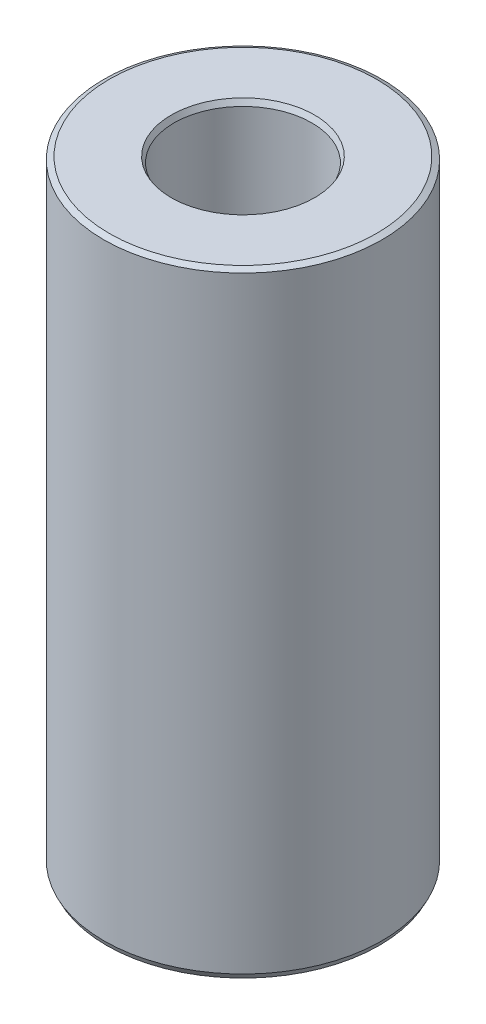
ISO-10303-21;
HEADER;
FILE_DESCRIPTION(('STEP AP214'),'2;1');
FILE_NAME('part.step','',(''),(''),'','','');
FILE_SCHEMA(('AUTOMOTIVE_DESIGN { 1 0 10303 214 1 1 1 1 }'));
ENDSEC;
DATA;
#1=APPLICATION_CONTEXT('core data for automotive mechanical design processes');
#2=APPLICATION_PROTOCOL_DEFINITION('international standard','automotive_design',2000,#1);
#3=PRODUCT_CONTEXT('',#1,'mechanical');
#4=PRODUCT('Part','Part','',(#3));
#5=PRODUCT_RELATED_PRODUCT_CATEGORY('part','',(#4));
#6=PRODUCT_DEFINITION_FORMATION('','',#4);
#7=PRODUCT_DEFINITION_CONTEXT('part definition',#1,'design');
#8=PRODUCT_DEFINITION('design','',#6,#7);
#9=PRODUCT_DEFINITION_SHAPE('','',#8);
#10=(LENGTH_UNIT() NAMED_UNIT(*) SI_UNIT(.MILLI.,.METRE.));
#11=(NAMED_UNIT(*) PLANE_ANGLE_UNIT() SI_UNIT($,.RADIAN.));
#12=(NAMED_UNIT(*) SI_UNIT($,.STERADIAN.) SOLID_ANGLE_UNIT());
#13=UNCERTAINTY_MEASURE_WITH_UNIT(LENGTH_MEASURE(1.E-05),#10,'distance_accuracy_value','');
#14=(GEOMETRIC_REPRESENTATION_CONTEXT(3) GLOBAL_UNCERTAINTY_ASSIGNED_CONTEXT((#13)) GLOBAL_UNIT_ASSIGNED_CONTEXT((#10,
#11,#12)) REPRESENTATION_CONTEXT('',''));
#15=CARTESIAN_POINT('',(0.,0.,0.));
#16=DIRECTION('',(0.,0.,1.));
#17=DIRECTION('',(1.,0.,0.));
#18=AXIS2_PLACEMENT_3D('',#15,#16,#17);
#19=CARTESIAN_POINT('',(0.,188.02306346274,0.));
#20=DIRECTION('',(0.,-1.,0.));
#21=DIRECTION('',(0.,0.,-1.));
#22=AXIS2_PLACEMENT_3D('',#19,#20,#21);
#23=CYLINDRICAL_SURFACE('',#22,42.5);
#24=CARTESIAN_POINT('',(0.,1.66942042183146,0.));
#25=DIRECTION('',(0.,1.,0.));
#26=DIRECTION('',(0.,0.,1.));
#27=AXIS2_PLACEMENT_3D('',#24,#25,#26);
#28=CIRCLE('',#27,42.5);
#29=CARTESIAN_POINT('',(0.,1.66942042183146,42.5));
#30=VERTEX_POINT('',#29);
#31=EDGE_CURVE('E10',#30,#30,#28,.T.);
#32=ORIENTED_EDGE('',*,*,#31,.T.);
#33=EDGE_LOOP('',(#32));
#34=FACE_BOUND('',#33,.T.);
#35=CARTESIAN_POINT('',(0.,187.179459044076,0.));
#36=DIRECTION('',(0.,1.,0.));
#37=DIRECTION('',(0.,0.,1.));
#38=AXIS2_PLACEMENT_3D('',#35,#36,#37);
#39=CIRCLE('',#38,42.5);
#40=CARTESIAN_POINT('',(0.,187.179459044076,42.5));
#41=VERTEX_POINT('',#40);
#42=EDGE_CURVE('E50',#41,#41,#39,.F.);
#43=ORIENTED_EDGE('',*,*,#42,.T.);
#44=EDGE_LOOP('',(#43));
#45=FACE_BOUND('',#44,.T.);
#46=ADVANCED_FACE('F39',(#34,#45),#23,.T.);
#47=CARTESIAN_POINT('',(0.,188.02306346274,0.));
#48=DIRECTION('',(0.,1.,0.));
#49=DIRECTION('',(0.,0.,1.));
#50=AXIS2_PLACEMENT_3D('',#47,#48,#49);
#51=PLANE('',#50);
#52=CARTESIAN_POINT('',(0.,188.02306346274,0.));
#53=DIRECTION('',(0.,1.,0.));
#54=DIRECTION('',(0.,0.,1.));
#55=AXIS2_PLACEMENT_3D('',#52,#53,#54);
#56=CIRCLE('',#55,21.9088627156745);
#57=CARTESIAN_POINT('',(0.,188.02306346274,21.9088627156745));
#58=VERTEX_POINT('',#57);
#59=EDGE_CURVE('E58',#58,#58,#56,.F.);
#60=ORIENTED_EDGE('',*,*,#59,.T.);
#61=EDGE_LOOP('',(#60));
#62=FACE_BOUND('',#61,.T.);
#63=CARTESIAN_POINT('',(0.,188.02306346274,0.));
#64=DIRECTION('',(0.,1.,0.));
#65=DIRECTION('',(0.,0.,1.));
#66=AXIS2_PLACEMENT_3D('',#63,#64,#65);
#67=CIRCLE('',#66,40.8305795781685);
#68=CARTESIAN_POINT('',(0.,188.02306346274,40.8305795781685));
#69=VERTEX_POINT('',#68);
#70=EDGE_CURVE('E61',#69,#69,#67,.T.);
#71=ORIENTED_EDGE('',*,*,#70,.T.);
#72=EDGE_LOOP('',(#71));
#73=FACE_BOUND('',#72,.T.);
#74=ADVANCED_FACE('F88',(#62,#73),#51,.T.);
#75=CARTESIAN_POINT('',(0.,0.,0.));
#76=DIRECTION('',(0.,1.,0.));
#77=DIRECTION('',(0.,0.,1.));
#78=AXIS2_PLACEMENT_3D('',#75,#76,#77);
#79=PLANE('',#78);
#80=CARTESIAN_POINT('',(0.,0.,0.));
#81=DIRECTION('',(0.,1.,0.));
#82=DIRECTION('',(0.,0.,1.));
#83=AXIS2_PLACEMENT_3D('',#80,#81,#82);
#84=CIRCLE('',#83,22.7346787188418);
#85=CARTESIAN_POINT('',(0.,0.,-22.7346787188418));
#86=VERTEX_POINT('',#85);
#87=EDGE_CURVE('E51',#86,#86,#84,.T.);
#88=ORIENTED_EDGE('',*,*,#87,.T.);
#89=EDGE_LOOP('',(#88));
#90=FACE_BOUND('',#89,.T.);
#91=CARTESIAN_POINT('',(0.,0.,0.));
#92=DIRECTION('',(0.,1.,0.));
#93=DIRECTION('',(0.,0.,1.));
#94=AXIS2_PLACEMENT_3D('',#91,#92,#93);
#95=CIRCLE('',#94,41.6563955813358);
#96=CARTESIAN_POINT('',(0.,0.,41.6563955813358));
#97=VERTEX_POINT('',#96);
#98=EDGE_CURVE('E54',#97,#97,#95,.F.);
#99=ORIENTED_EDGE('',*,*,#98,.T.);
#100=EDGE_LOOP('',(#99));
#101=FACE_BOUND('',#100,.T.);
#102=ADVANCED_FACE('F83',(#90,#101),#79,.F.);
#103=CARTESIAN_POINT('',(0.,188.02306346274,0.));
#104=DIRECTION('',(0.,-1.,0.));
#105=DIRECTION('',(0.,0.,-1.));
#106=AXIS2_PLACEMENT_3D('',#103,#104,#105);
#107=CYLINDRICAL_SURFACE('',#106,21.0652582970103);
#108=CARTESIAN_POINT('',(0.,186.353643040909,0.));
#109=DIRECTION('',(0.,1.,0.));
#110=DIRECTION('',(0.,0.,1.));
#111=AXIS2_PLACEMENT_3D('',#108,#109,#110);
#112=CIRCLE('',#111,21.0652582970103);
#113=CARTESIAN_POINT('',(0.,186.353643040909,-21.0652582970103));
#114=VERTEX_POINT('',#113);
#115=EDGE_CURVE('E67',#114,#114,#112,.T.);
#116=CARTESIAN_POINT('',(0.,0.843604418664212,0.));
#117=DIRECTION('',(0.,1.,0.));
#118=DIRECTION('',(0.,0.,1.));
#119=AXIS2_PLACEMENT_3D('',#116,#117,#118);
#120=CIRCLE('',#119,21.0652582970103);
#121=CARTESIAN_POINT('',(0.,0.843604418664184,-21.0652582970103));
#122=VERTEX_POINT('',#121);
#123=EDGE_CURVE('E69',#122,#122,#120,.F.);
#124=CARTESIAN_POINT('',(0.,186.353643040909,-21.0652582970103));
#125=CARTESIAN_POINT('',(0.,184.42124680526,-21.0652582970103));
#126=CARTESIAN_POINT('',(0.,182.488850569612,-21.0652582970103));
#127=CARTESIAN_POINT('',(0.,178.624058098315,-21.0652582970103));
#128=CARTESIAN_POINT('',(0.,176.691661862667,-21.0652582970103));
#129=CARTESIAN_POINT('',(0.,172.82686939137,-21.0652582970103));
#130=CARTESIAN_POINT('',(0.,170.894473155722,-21.0652582970103));
#131=CARTESIAN_POINT('',(0.,167.029680684425,-21.0652582970103));
#132=CARTESIAN_POINT('',(0.,165.097284448777,-21.0652582970103));
#133=CARTESIAN_POINT('',(0.,161.23249197748,-21.0652582970103));
#134=CARTESIAN_POINT('',(0.,159.300095741831,-21.0652582970103));
#135=CARTESIAN_POINT('',(0.,155.435303270535,-21.0652582970103));
#136=CARTESIAN_POINT('',(0.,153.502907034886,-21.0652582970103));
#137=CARTESIAN_POINT('',(0.,149.63811456359,-21.0652582970103));
#138=CARTESIAN_POINT('',(0.,147.705718327941,-21.0652582970103));
#139=CARTESIAN_POINT('',(0.,143.840925856644,-21.0652582970103));
#140=CARTESIAN_POINT('',(0.,141.908529620996,-21.0652582970103));
#141=CARTESIAN_POINT('',(0.,138.043737149699,-21.0652582970103));
#142=CARTESIAN_POINT('',(0.,136.111340914051,-21.0652582970103));
#143=CARTESIAN_POINT('',(0.,132.246548442754,-21.0652582970103));
#144=CARTESIAN_POINT('',(0.,130.314152207106,-21.0652582970103));
#145=CARTESIAN_POINT('',(0.,126.449359735809,-21.0652582970103));
#146=CARTESIAN_POINT('',(0.,124.516963500161,-21.0652582970103));
#147=CARTESIAN_POINT('',(0.,120.652171028864,-21.0652582970103));
#148=CARTESIAN_POINT('',(0.,118.719774793215,-21.0652582970103));
#149=CARTESIAN_POINT('',(0.,114.854982321919,-21.0652582970103));
#150=CARTESIAN_POINT('',(0.,112.92258608627,-21.0652582970103));
#151=CARTESIAN_POINT('',(0.,109.057793614974,-21.0652582970103));
#152=CARTESIAN_POINT('',(0.,107.125397379325,-21.0652582970103));
#153=CARTESIAN_POINT('',(0.,103.260604908028,-21.0652582970103));
#154=CARTESIAN_POINT('',(0.,101.32820867238,-21.0652582970103));
#155=CARTESIAN_POINT('',(0.,97.4634162010832,-21.0652582970103));
#156=CARTESIAN_POINT('',(0.,95.5310199654348,-21.0652582970103));
#157=CARTESIAN_POINT('',(0.,91.6662274941381,-21.0652582970103));
#158=CARTESIAN_POINT('',(0.,89.7338312584897,-21.0652582970103));
#159=CARTESIAN_POINT('',(0.,85.8690387871929,-21.0652582970103));
#160=CARTESIAN_POINT('',(0.,83.9366425515446,-21.0652582970103));
#161=CARTESIAN_POINT('',(0.,80.0718500802478,-21.0652582970103));
#162=CARTESIAN_POINT('',(0.,78.1394538445994,-21.0652582970103));
#163=CARTESIAN_POINT('',(0.,74.2746613733027,-21.0652582970103));
#164=CARTESIAN_POINT('',(0.,72.3422651376543,-21.0652582970103));
#165=CARTESIAN_POINT('',(0.,68.4774726663575,-21.0652582970103));
#166=CARTESIAN_POINT('',(0.,66.5450764307091,-21.0652582970103));
#167=CARTESIAN_POINT('',(0.,62.6802839594124,-21.0652582970103));
#168=CARTESIAN_POINT('',(0.,60.747887723764,-21.0652582970103));
#169=CARTESIAN_POINT('',(0.,56.8830952524672,-21.0652582970103));
#170=CARTESIAN_POINT('',(0.,54.9506990168188,-21.0652582970103));
#171=CARTESIAN_POINT('',(0.,51.0859065455221,-21.0652582970103));
#172=CARTESIAN_POINT('',(0.,49.1535103098737,-21.0652582970103));
#173=CARTESIAN_POINT('',(0.,45.2887178385769,-21.0652582970103));
#174=CARTESIAN_POINT('',(0.,43.3563216029285,-21.0652582970103));
#175=CARTESIAN_POINT('',(0.,39.4915291316318,-21.0652582970103));
#176=CARTESIAN_POINT('',(0.,37.5591328959834,-21.0652582970103));
#177=CARTESIAN_POINT('',(0.,33.6943404246867,-21.0652582970103));
#178=CARTESIAN_POINT('',(0.,31.7619441890383,-21.0652582970103));
#179=CARTESIAN_POINT('',(0.,27.8971517177415,-21.0652582970103));
#180=CARTESIAN_POINT('',(0.,25.9647554820931,-21.0652582970103));
#181=CARTESIAN_POINT('',(0.,22.0999630107964,-21.0652582970103));
#182=CARTESIAN_POINT('',(0.,20.167566775148,-21.0652582970103));
#183=CARTESIAN_POINT('',(0.,16.3027743038512,-21.0652582970103));
#184=CARTESIAN_POINT('',(0.,14.3703780682029,-21.0652582970103));
#185=CARTESIAN_POINT('',(0.,10.5055855969061,-21.0652582970103));
#186=CARTESIAN_POINT('',(0.,8.5731893612577,-21.0652582970103));
#187=CARTESIAN_POINT('',(0.,4.70839688996093,-21.0652582970103));
#188=CARTESIAN_POINT('',(0.,2.77600065431256,-21.0652582970103));
#189=CARTESIAN_POINT('',(0.,0.843604418664184,-21.0652582970103));
#190=B_SPLINE_CURVE_WITH_KNOTS('',3,(#124,#125,#126,#127,#128,#129,#130,#131,#132,#133,#134,
#135,#136,#137,#138,#139,#140,#141,#142,#143,#144,#145,#146,#147,#148,#149,#150,#151,#152,#153,
#154,#155,#156,#157,#158,#159,#160,#161,#162,#163,#164,#165,#166,#167,#168,#169,#170,#171,#172,
#173,#174,#175,#176,#177,#178,#179,#180,#181,#182,#183,#184,#185,#186,#187,#188,#189),
.UNSPECIFIED.,.F.,.F.,(4,2,2,2,2,2,2,2,2,2,2,2,2,2,2,2,2,2,2,2,2,2,2,2,2,2,2,2,2,2,2,2,4),(0.,
5.79718870694512,11.5943774138903,17.3915661208354,23.1887548277805,28.9859435347257,
34.7831322416708,40.580320948616,46.3775096555611,52.1746983625063,57.9718870694514,
63.7690757763966,69.5662644833417,75.3634531902868,81.160641897232,86.9578306041771,
92.7550193111223,98.5522080180674,104.349396725013,110.146585431958,115.943774138903,
121.740962845848,127.538151552793,133.335340259738,139.132528966683,144.929717673629,
150.726906380574,156.524095087519,162.321283794464,168.118472501409,173.915661208354,
179.712849915299,185.510038622245),.UNSPECIFIED.);
#191=EDGE_CURVE('BSEAM71',#114,#122,#190,.T.);
#192=ORIENTED_EDGE('',*,*,#115,.T.);
#193=ORIENTED_EDGE('',*,*,#123,.T.);
#194=ORIENTED_EDGE('',*,*,#191,.T.);
#195=ORIENTED_EDGE('',*,*,#191,.F.);
#196=EDGE_LOOP('',(#192,#194,#193,#195));
#197=FACE_BOUND('',#196,.T.);
#198=ADVANCED_FACE('F71',(#197),#107,.F.);
#199=CARTESIAN_POINT('',(0.,186.353643040909,0.));
#200=DIRECTION('',(0.,1.,0.));
#201=DIRECTION('',(0.,0.,1.));
#202=AXIS2_PLACEMENT_3D('',#199,#200,#201);
#203=CONICAL_SURFACE('',#202,21.0652582970103,0.467900697116581);
#204=ORIENTED_EDGE('',*,*,#59,.F.);
#205=EDGE_LOOP('',(#204));
#206=FACE_BOUND('',#205,.T.);
#207=ORIENTED_EDGE('',*,*,#115,.F.);
#208=EDGE_LOOP('',(#207));
#209=FACE_BOUND('',#208,.T.);
#210=ADVANCED_FACE('F77',(#206,#209),#203,.F.);
#211=CARTESIAN_POINT('',(0.,0.,0.));
#212=DIRECTION('',(0.,-1.,0.));
#213=DIRECTION('',(0.,0.,-1.));
#214=AXIS2_PLACEMENT_3D('',#211,#212,#213);
#215=CONICAL_SURFACE('',#214,22.7346787188418,1.10289562967832);
#216=CARTESIAN_POINT('',(0.,0.843604418664212,-21.0652582970103));
#217=CARTESIAN_POINT('',(0.,0.83481687263646,-21.0826480930711));
#218=CARTESIAN_POINT('',(0.,0.826029326608708,-21.1000378891318));
#219=CARTESIAN_POINT('',(0.,0.808454234553203,-21.1348174812533));
#220=CARTESIAN_POINT('',(0.,0.799666688525451,-21.1522072773141));
#221=CARTESIAN_POINT('',(0.,0.782091596469947,-21.1869868694355));
#222=CARTESIAN_POINT('',(0.,0.773304050442194,-21.2043766654963));
#223=CARTESIAN_POINT('',(0.,0.75572895838669,-21.2391562576178));
#224=CARTESIAN_POINT('',(0.,0.746941412358938,-21.2565460536785));
#225=CARTESIAN_POINT('',(0.,0.729366320303434,-21.2913256458));
#226=CARTESIAN_POINT('',(0.,0.720578774275681,-21.3087154418608));
#227=CARTESIAN_POINT('',(0.,0.703003682220177,-21.3434950339822));
#228=CARTESIAN_POINT('',(0.,0.694216136192425,-21.360884830043));
#229=CARTESIAN_POINT('',(0.,0.67664104413692,-21.3956644221645));
#230=CARTESIAN_POINT('',(0.,0.667853498109168,-21.4130542182252));
#231=CARTESIAN_POINT('',(0.,0.650278406053663,-21.4478338103467));
#232=CARTESIAN_POINT('',(0.,0.641490860025911,-21.4652236064075));
#233=CARTESIAN_POINT('',(0.,0.623915767970407,-21.5000031985289));
#234=CARTESIAN_POINT('',(0.,0.615128221942655,-21.5173929945897));
#235=CARTESIAN_POINT('',(0.,0.59755312988715,-21.5521725867112));
#236=CARTESIAN_POINT('',(0.,0.588765583859398,-21.5695623827719));
#237=CARTESIAN_POINT('',(0.,0.571190491803894,-21.6043419748934));
#238=CARTESIAN_POINT('',(0.,0.562402945776142,-21.6217317709542));
#239=CARTESIAN_POINT('',(0.,0.544827853720637,-21.6565113630756));
#240=CARTESIAN_POINT('',(0.,0.536040307692884,-21.6739011591364));
#241=CARTESIAN_POINT('',(0.,0.51846521563738,-21.7086807512579));
#242=CARTESIAN_POINT('',(0.,0.509677669609628,-21.7260705473186));
#243=CARTESIAN_POINT('',(0.,0.492102577554124,-21.7608501394401));
#244=CARTESIAN_POINT('',(0.,0.483315031526372,-21.7782399355009));
#245=CARTESIAN_POINT('',(0.,0.465739939470867,-21.8130195276223));
#246=CARTESIAN_POINT('',(0.,0.456952393443115,-21.8304093236831));
#247=CARTESIAN_POINT('',(0.,0.439377301387611,-21.8651889158046));
#248=CARTESIAN_POINT('',(0.,0.430589755359859,-21.8825787118653));
#249=CARTESIAN_POINT('',(0.,0.413014663304354,-21.9173583039868));
#250=CARTESIAN_POINT('',(0.,0.404227117276601,-21.9347481000476));
#251=CARTESIAN_POINT('',(0.,0.386652025221097,-21.969527692169));
#252=CARTESIAN_POINT('',(0.,0.377864479193345,-21.9869174882298));
#253=CARTESIAN_POINT('',(0.,0.360289387137841,-22.0216970803513));
#254=CARTESIAN_POINT('',(0.,0.351501841110088,-22.039086876412));
#255=CARTESIAN_POINT('',(0.,0.333926749054584,-22.0738664685335));
#256=CARTESIAN_POINT('',(0.,0.325139203026832,-22.0912562645943));
#257=CARTESIAN_POINT('',(0.,0.307564110971327,-22.1260358567157));
#258=CARTESIAN_POINT('',(0.,0.298776564943575,-22.1434256527765));
#259=CARTESIAN_POINT('',(0.,0.28120147288807,-22.178205244898));
#260=CARTESIAN_POINT('',(0.,0.272413926860318,-22.1955950409587));
#261=CARTESIAN_POINT('',(0.,0.254838834804814,-22.2303746330802));
#262=CARTESIAN_POINT('',(0.,0.246051288777062,-22.247764429141));
#263=CARTESIAN_POINT('',(0.,0.228476196721557,-22.2825440212624));
#264=CARTESIAN_POINT('',(0.,0.219688650693805,-22.2999338173232));
#265=CARTESIAN_POINT('',(0.,0.202113558638301,-22.3347134094447));
#266=CARTESIAN_POINT('',(0.,0.193326012610549,-22.3521032055054));
#267=CARTESIAN_POINT('',(0.,0.175750920555044,-22.3868827976269));
#268=CARTESIAN_POINT('',(0.,0.166963374527292,-22.4042725936877));
#269=CARTESIAN_POINT('',(0.,0.149388282471787,-22.4390521858091));
#270=CARTESIAN_POINT('',(0.,0.140600736444035,-22.4564419818699));
#271=CARTESIAN_POINT('',(0.,0.123025644388531,-22.4912215739914));
#272=CARTESIAN_POINT('',(0.,0.114238098360779,-22.5086113700521));
#273=CARTESIAN_POINT('',(0.,0.0966630063052744,-22.5433909621736));
#274=CARTESIAN_POINT('',(0.,0.0878754602775224,-22.5607807582344));
#275=CARTESIAN_POINT('',(0.,0.0703003682220179,-22.5955603503558));
#276=CARTESIAN_POINT('',(0.,0.0615128221942653,-22.6129501464166));
#277=CARTESIAN_POINT('',(0.,0.0439377301387607,-22.6477297385381));
#278=CARTESIAN_POINT('',(0.,0.0351501841110087,-22.6651195345988));
#279=CARTESIAN_POINT('',(0.,0.0175750920555046,-22.6998991267203));
#280=CARTESIAN_POINT('',(0.,0.00878754602775253,-22.7172889227811));
#281=CARTESIAN_POINT('',(0.,0.,-22.7346787188418));
#282=B_SPLINE_CURVE_WITH_KNOTS('',3,(#216,#217,#218,#219,#220,#221,#222,#223,#224,#225,#226,
#227,#228,#229,#230,#231,#232,#233,#234,#235,#236,#237,#238,#239,#240,#241,#242,#243,#244,#245,
#246,#247,#248,#249,#250,#251,#252,#253,#254,#255,#256,#257,#258,#259,#260,#261,#262,#263,#264,
#265,#266,#267,#268,#269,#270,#271,#272,#273,#274,#275,#276,#277,#278,#279,#280,#281),
.UNSPECIFIED.,.F.,.F.,(4,2,2,2,2,2,2,2,2,2,2,2,2,2,2,2,2,2,2,2,2,2,2,2,2,2,2,2,2,2,2,2,4),(0.,
0.0584519781531592,0.116903956306318,0.175355934459474,0.233807912612634,0.292259890765793,
0.350711868918952,0.409163847072108,0.467615825225267,0.526067803378427,0.584519781531586,
0.642971759684745,0.701423737837901,0.75987571599106,0.81832769414422,0.876779672297379,
0.935231650450538,0.993683628603694,1.05213560675685,1.11058758491001,1.16903956306317,
1.22749154121633,1.28594351936949,1.34439549752265,1.4028474756758,1.46129945382896,
1.51975143198212,1.57820341013528,1.63665538828844,1.6951073664416,1.75355934459475,
1.81201132274791,1.87046330090107),.UNSPECIFIED.);
#283=EDGE_CURVE('BSEAM73',#122,#86,#282,.T.);
#284=ORIENTED_EDGE('',*,*,#123,.F.);
#285=ORIENTED_EDGE('',*,*,#87,.F.);
#286=ORIENTED_EDGE('',*,*,#283,.T.);
#287=ORIENTED_EDGE('',*,*,#283,.F.);
#288=EDGE_LOOP('',(#284,#286,#285,#287));
#289=FACE_BOUND('',#288,.T.);
#290=ADVANCED_FACE('F73',(#289),#215,.F.);
#291=CARTESIAN_POINT('',(0.,1.66942042183146,0.));
#292=DIRECTION('',(0.,1.,0.));
#293=DIRECTION('',(0.,0.,1.));
#294=AXIS2_PLACEMENT_3D('',#291,#292,#293);
#295=CONICAL_SURFACE('',#294,42.5,0.467900697116583);
#296=ORIENTED_EDGE('',*,*,#98,.F.);
#297=EDGE_LOOP('',(#296));
#298=FACE_BOUND('',#297,.T.);
#299=ORIENTED_EDGE('',*,*,#31,.F.);
#300=EDGE_LOOP('',(#299));
#301=FACE_BOUND('',#300,.T.);
#302=ADVANCED_FACE('F76',(#298,#301),#295,.T.);
#303=CARTESIAN_POINT('',(0.,188.02306346274,0.));
#304=DIRECTION('',(0.,-1.,0.));
#305=DIRECTION('',(0.,0.,-1.));
#306=AXIS2_PLACEMENT_3D('',#303,#304,#305);
#307=CONICAL_SURFACE('',#306,40.8305795781685,1.10289562967833);
#308=ORIENTED_EDGE('',*,*,#42,.F.);
#309=EDGE_LOOP('',(#308));
#310=FACE_BOUND('',#309,.T.);
#311=ORIENTED_EDGE('',*,*,#70,.F.);
#312=EDGE_LOOP('',(#311));
#313=FACE_BOUND('',#312,.T.);
#314=ADVANCED_FACE('F45',(#310,#313),#307,.T.);
#315=CLOSED_SHELL('',(#46,#74,#102,#198,#210,#290,#302,#314));
#316=MANIFOLD_SOLID_BREP('B2',#315);
#317=ADVANCED_BREP_SHAPE_REPRESENTATION('',(#18,#316),#14);
#318=SHAPE_DEFINITION_REPRESENTATION(#9,#317);
ENDSEC;
END-ISO-10303-21;
